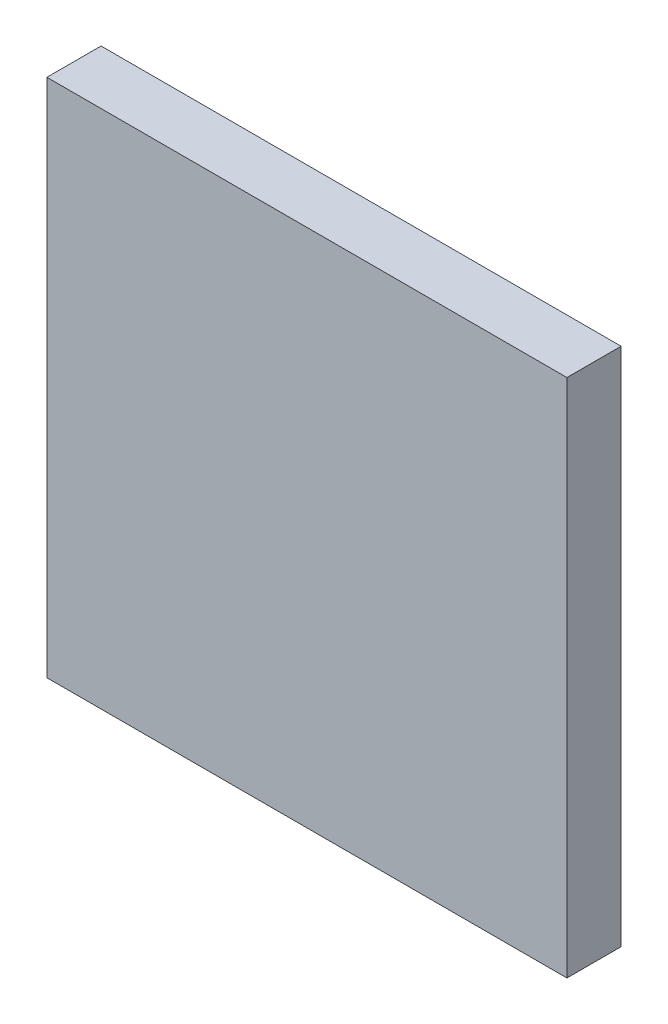
ISO-10303-21;
HEADER;
FILE_DESCRIPTION(('STEP AP214'),'2;1');
FILE_NAME('part.step','',(''),(''),'','','');
FILE_SCHEMA(('AUTOMOTIVE_DESIGN { 1 0 10303 214 1 1 1 1 }'));
ENDSEC;
DATA;
#1=APPLICATION_CONTEXT('core data for automotive mechanical design processes');
#2=APPLICATION_PROTOCOL_DEFINITION('international standard','automotive_design',2000,#1);
#3=PRODUCT_CONTEXT('',#1,'mechanical');
#4=PRODUCT('Part','Part','',(#3));
#5=PRODUCT_RELATED_PRODUCT_CATEGORY('part','',(#4));
#6=PRODUCT_DEFINITION_FORMATION('','',#4);
#7=PRODUCT_DEFINITION_CONTEXT('part definition',#1,'design');
#8=PRODUCT_DEFINITION('design','',#6,#7);
#9=PRODUCT_DEFINITION_SHAPE('','',#8);
#10=(LENGTH_UNIT() NAMED_UNIT(*) SI_UNIT(.MILLI.,.METRE.));
#11=(NAMED_UNIT(*) PLANE_ANGLE_UNIT() SI_UNIT($,.RADIAN.));
#12=(NAMED_UNIT(*) SI_UNIT($,.STERADIAN.) SOLID_ANGLE_UNIT());
#13=UNCERTAINTY_MEASURE_WITH_UNIT(LENGTH_MEASURE(1.E-05),#10,'distance_accuracy_value','');
#14=(GEOMETRIC_REPRESENTATION_CONTEXT(3) GLOBAL_UNCERTAINTY_ASSIGNED_CONTEXT((#13)) GLOBAL_UNIT_ASSIGNED_CONTEXT((#10,
#11,#12)) REPRESENTATION_CONTEXT('',''));
#15=CARTESIAN_POINT('',(0.,0.,0.));
#16=DIRECTION('',(0.,0.,1.));
#17=DIRECTION('',(1.,0.,0.));
#18=AXIS2_PLACEMENT_3D('',#15,#16,#17);
#19=CARTESIAN_POINT('',(-24.,-24.,5.));
#20=DIRECTION('',(1.,0.,0.));
#21=DIRECTION('',(0.,0.,-1.));
#22=AXIS2_PLACEMENT_3D('',#19,#20,#21);
#23=PLANE('',#22);
#24=DIRECTION('',(0.,-1.,0.));
#25=VECTOR('',#24,1.);
#26=CARTESIAN_POINT('',(-24.,-24.,0.));
#27=LINE('',#26,#25);
#28=CARTESIAN_POINT('',(-24.,24.,0.));
#29=VERTEX_POINT('',#28);
#30=CARTESIAN_POINT('',(-24.,-24.,0.));
#31=VERTEX_POINT('',#30);
#32=EDGE_CURVE('E100',#29,#31,#27,.T.);
#33=ORIENTED_EDGE('',*,*,#32,.T.);
#34=DIRECTION('',(0.,0.,-1.));
#35=VECTOR('',#34,1.);
#36=CARTESIAN_POINT('',(-24.,-24.,5.));
#37=LINE('',#36,#35);
#38=CARTESIAN_POINT('',(-24.,-24.,5.));
#39=VERTEX_POINT('',#38);
#40=EDGE_CURVE('E11',#39,#31,#37,.T.);
#41=ORIENTED_EDGE('',*,*,#40,.F.);
#42=DIRECTION('',(0.,-1.,0.));
#43=VECTOR('',#42,1.);
#44=CARTESIAN_POINT('',(-24.,-24.,5.));
#45=LINE('',#44,#43);
#46=CARTESIAN_POINT('',(-24.,24.,5.));
#47=VERTEX_POINT('',#46);
#48=EDGE_CURVE('E88',#47,#39,#45,.T.);
#49=ORIENTED_EDGE('',*,*,#48,.F.);
#50=DIRECTION('',(0.,0.,-1.));
#51=VECTOR('',#50,1.);
#52=CARTESIAN_POINT('',(-24.,24.,5.));
#53=LINE('',#52,#51);
#54=EDGE_CURVE('E96',#47,#29,#53,.T.);
#55=ORIENTED_EDGE('',*,*,#54,.T.);
#56=EDGE_LOOP('',(#33,#41,#49,#55));
#57=FACE_BOUND('',#56,.T.);
#58=ADVANCED_FACE('F37',(#57),#23,.F.);
#59=CARTESIAN_POINT('',(24.,-24.,5.));
#60=DIRECTION('',(0.,1.,0.));
#61=DIRECTION('',(0.,0.,1.));
#62=AXIS2_PLACEMENT_3D('',#59,#60,#61);
#63=PLANE('',#62);
#64=DIRECTION('',(1.,0.,0.));
#65=VECTOR('',#64,1.);
#66=CARTESIAN_POINT('',(24.,-24.,0.));
#67=LINE('',#66,#65);
#68=CARTESIAN_POINT('',(24.,-24.,0.));
#69=VERTEX_POINT('',#68);
#70=EDGE_CURVE('E92',#31,#69,#67,.T.);
#71=ORIENTED_EDGE('',*,*,#70,.T.);
#72=DIRECTION('',(0.,0.,-1.));
#73=VECTOR('',#72,1.);
#74=CARTESIAN_POINT('',(24.,-24.,5.));
#75=LINE('',#74,#73);
#76=CARTESIAN_POINT('',(24.,-24.,5.));
#77=VERTEX_POINT('',#76);
#78=EDGE_CURVE('E45',#77,#69,#75,.T.);
#79=ORIENTED_EDGE('',*,*,#78,.F.);
#80=DIRECTION('',(1.,0.,0.));
#81=VECTOR('',#80,1.);
#82=CARTESIAN_POINT('',(24.,-24.,5.));
#83=LINE('',#82,#81);
#84=EDGE_CURVE('E83',#39,#77,#83,.T.);
#85=ORIENTED_EDGE('',*,*,#84,.F.);
#86=ORIENTED_EDGE('',*,*,#40,.T.);
#87=EDGE_LOOP('',(#71,#79,#85,#86));
#88=FACE_BOUND('',#87,.T.);
#89=ADVANCED_FACE('F91',(#88),#63,.F.);
#90=CARTESIAN_POINT('',(24.,-24.,5.));
#91=DIRECTION('',(-1.,0.,0.));
#92=DIRECTION('',(0.,0.,1.));
#93=AXIS2_PLACEMENT_3D('',#90,#91,#92);
#94=PLANE('',#93);
#95=DIRECTION('',(0.,1.,0.));
#96=VECTOR('',#95,1.);
#97=CARTESIAN_POINT('',(24.,-24.,0.));
#98=LINE('',#97,#96);
#99=CARTESIAN_POINT('',(24.,24.,0.));
#100=VERTEX_POINT('',#99);
#101=EDGE_CURVE('E70',#69,#100,#98,.T.);
#102=ORIENTED_EDGE('',*,*,#101,.T.);
#103=DIRECTION('',(0.,0.,-1.));
#104=VECTOR('',#103,1.);
#105=CARTESIAN_POINT('',(24.,24.,5.));
#106=LINE('',#105,#104);
#107=CARTESIAN_POINT('',(24.,24.,5.));
#108=VERTEX_POINT('',#107);
#109=EDGE_CURVE('E93',#108,#100,#106,.T.);
#110=ORIENTED_EDGE('',*,*,#109,.F.);
#111=DIRECTION('',(0.,1.,0.));
#112=VECTOR('',#111,1.);
#113=CARTESIAN_POINT('',(24.,-24.,5.));
#114=LINE('',#113,#112);
#115=EDGE_CURVE('E86',#77,#108,#114,.T.);
#116=ORIENTED_EDGE('',*,*,#115,.F.);
#117=ORIENTED_EDGE('',*,*,#78,.T.);
#118=EDGE_LOOP('',(#102,#110,#116,#117));
#119=FACE_BOUND('',#118,.T.);
#120=ADVANCED_FACE('F94',(#119),#94,.F.);
#121=CARTESIAN_POINT('',(24.,24.,5.));
#122=DIRECTION('',(0.,-1.,0.));
#123=DIRECTION('',(0.,0.,-1.));
#124=AXIS2_PLACEMENT_3D('',#121,#122,#123);
#125=PLANE('',#124);
#126=DIRECTION('',(-1.,0.,0.));
#127=VECTOR('',#126,1.);
#128=CARTESIAN_POINT('',(24.,24.,0.));
#129=LINE('',#128,#127);
#130=EDGE_CURVE('E76',#100,#29,#129,.T.);
#131=ORIENTED_EDGE('',*,*,#130,.T.);
#132=ORIENTED_EDGE('',*,*,#54,.F.);
#133=DIRECTION('',(-1.,0.,0.));
#134=VECTOR('',#133,1.);
#135=CARTESIAN_POINT('',(24.,24.,5.));
#136=LINE('',#135,#134);
#137=EDGE_CURVE('E53',#108,#47,#136,.T.);
#138=ORIENTED_EDGE('',*,*,#137,.F.);
#139=ORIENTED_EDGE('',*,*,#109,.T.);
#140=EDGE_LOOP('',(#131,#132,#138,#139));
#141=FACE_BOUND('',#140,.T.);
#142=ADVANCED_FACE('F107',(#141),#125,.F.);
#143=CARTESIAN_POINT('',(0.,0.,5.));
#144=DIRECTION('',(0.,0.,1.));
#145=DIRECTION('',(1.,0.,0.));
#146=AXIS2_PLACEMENT_3D('',#143,#144,#145);
#147=PLANE('',#146);
#148=ORIENTED_EDGE('',*,*,#48,.T.);
#149=ORIENTED_EDGE('',*,*,#84,.T.);
#150=ORIENTED_EDGE('',*,*,#115,.T.);
#151=ORIENTED_EDGE('',*,*,#137,.T.);
#152=EDGE_LOOP('',(#148,#149,#150,#151));
#153=FACE_BOUND('',#152,.T.);
#154=ADVANCED_FACE('F84',(#153),#147,.T.);
#155=CARTESIAN_POINT('',(0.,0.,0.));
#156=DIRECTION('',(0.,0.,1.));
#157=DIRECTION('',(1.,0.,0.));
#158=AXIS2_PLACEMENT_3D('',#155,#156,#157);
#159=PLANE('',#158);
#160=ORIENTED_EDGE('',*,*,#32,.F.);
#161=ORIENTED_EDGE('',*,*,#130,.F.);
#162=ORIENTED_EDGE('',*,*,#101,.F.);
#163=ORIENTED_EDGE('',*,*,#70,.F.);
#164=EDGE_LOOP('',(#160,#161,#162,#163));
#165=FACE_BOUND('',#164,.T.);
#166=ADVANCED_FACE('F110',(#165),#159,.F.);
#167=CLOSED_SHELL('',(#58,#89,#120,#142,#154,#166));
#168=MANIFOLD_SOLID_BREP('B2',#167);
#169=ADVANCED_BREP_SHAPE_REPRESENTATION('',(#18,#168),#14);
#170=SHAPE_DEFINITION_REPRESENTATION(#9,#169);
ENDSEC;
END-ISO-10303-21;
